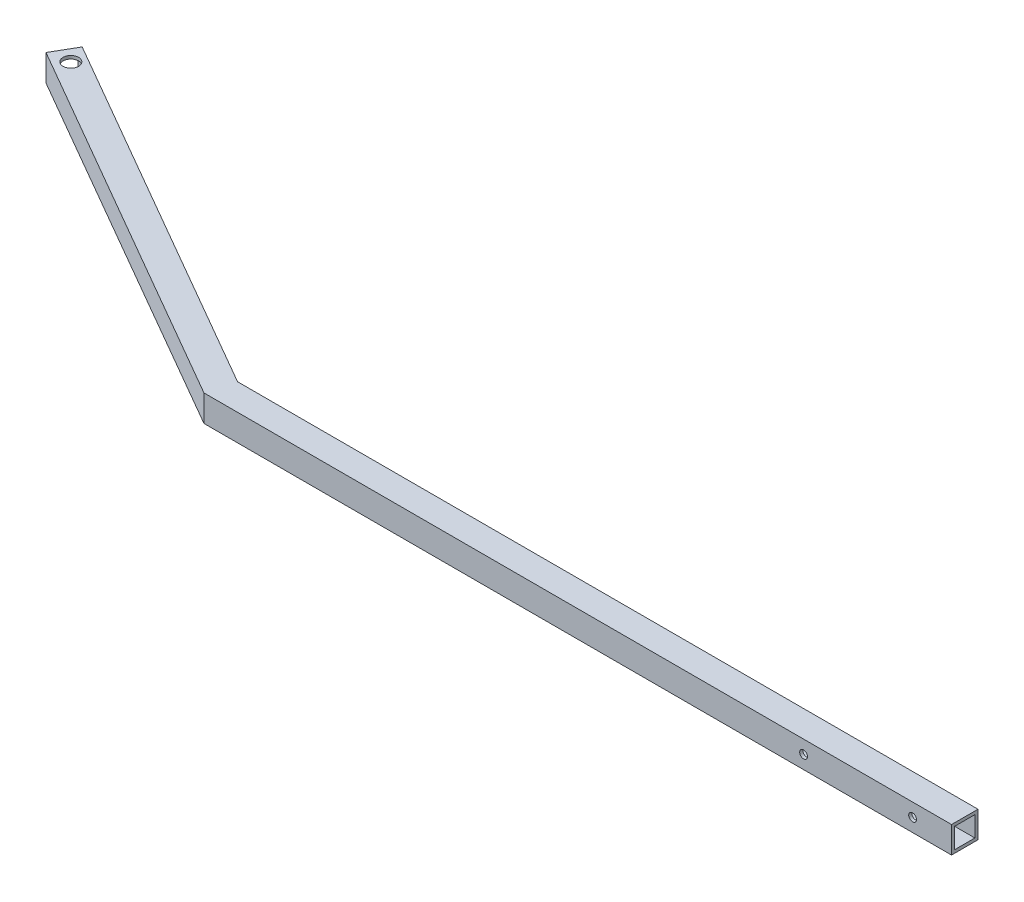
ISO-10303-21;
HEADER;
FILE_DESCRIPTION(('STEP AP214'),'2;1');
FILE_NAME('part.step','',(''),(''),'','','');
FILE_SCHEMA(('AUTOMOTIVE_DESIGN { 1 0 10303 214 1 1 1 1 }'));
ENDSEC;
DATA;
#1=APPLICATION_CONTEXT('core data for automotive mechanical design processes');
#2=APPLICATION_PROTOCOL_DEFINITION('international standard','automotive_design',2000,#1);
#3=PRODUCT_CONTEXT('',#1,'mechanical');
#4=PRODUCT('Part','Part','',(#3));
#5=PRODUCT_RELATED_PRODUCT_CATEGORY('part','',(#4));
#6=PRODUCT_DEFINITION_FORMATION('','',#4);
#7=PRODUCT_DEFINITION_CONTEXT('part definition',#1,'design');
#8=PRODUCT_DEFINITION('design','',#6,#7);
#9=PRODUCT_DEFINITION_SHAPE('','',#8);
#10=(LENGTH_UNIT() NAMED_UNIT(*) SI_UNIT(.MILLI.,.METRE.));
#11=(NAMED_UNIT(*) PLANE_ANGLE_UNIT() SI_UNIT($,.RADIAN.));
#12=(NAMED_UNIT(*) SI_UNIT($,.STERADIAN.) SOLID_ANGLE_UNIT());
#13=UNCERTAINTY_MEASURE_WITH_UNIT(LENGTH_MEASURE(1.E-05),#10,'distance_accuracy_value','');
#14=(GEOMETRIC_REPRESENTATION_CONTEXT(3) GLOBAL_UNCERTAINTY_ASSIGNED_CONTEXT((#13)) GLOBAL_UNIT_ASSIGNED_CONTEXT((#10,
#11,#12)) REPRESENTATION_CONTEXT('',''));
#15=CARTESIAN_POINT('',(0.,0.,0.));
#16=DIRECTION('',(0.,0.,1.));
#17=DIRECTION('',(1.,0.,0.));
#18=AXIS2_PLACEMENT_3D('',#15,#16,#17);
#19=CARTESIAN_POINT('',(0.,-21.59,-21.59));
#20=DIRECTION('',(1.,0.,0.));
#21=DIRECTION('',(0.,0.,-1.));
#22=AXIS2_PLACEMENT_3D('',#19,#20,#21);
#23=PLANE('',#22);
#24=DIRECTION('',(0.,0.,-1.));
#25=VECTOR('',#24,1.);
#26=CARTESIAN_POINT('',(0.,0.,-21.59));
#27=LINE('',#26,#25);
#28=CARTESIAN_POINT('',(0.,0.,0.));
#29=VERTEX_POINT('',#28);
#30=CARTESIAN_POINT('',(0.,0.,-21.59));
#31=VERTEX_POINT('',#30);
#32=EDGE_CURVE('E169',#29,#31,#27,.T.);
#33=ORIENTED_EDGE('',*,*,#32,.F.);
#34=DIRECTION('',(0.,1.,0.));
#35=VECTOR('',#34,1.);
#36=CARTESIAN_POINT('',(0.,-21.59,0.));
#37=LINE('',#36,#35);
#38=CARTESIAN_POINT('',(0.,-21.59,0.));
#39=VERTEX_POINT('',#38);
#40=EDGE_CURVE('E11',#39,#29,#37,.T.);
#41=ORIENTED_EDGE('',*,*,#40,.F.);
#42=DIRECTION('',(0.,0.,-1.));
#43=VECTOR('',#42,1.);
#44=CARTESIAN_POINT('',(0.,-21.59,-21.59));
#45=LINE('',#44,#43);
#46=CARTESIAN_POINT('',(0.,-21.59,-21.59));
#47=VERTEX_POINT('',#46);
#48=EDGE_CURVE('E180',#39,#47,#45,.T.);
#49=ORIENTED_EDGE('',*,*,#48,.T.);
#50=DIRECTION('',(0.,1.,0.));
#51=VECTOR('',#50,1.);
#52=CARTESIAN_POINT('',(0.,-21.59,-21.59));
#53=LINE('',#52,#51);
#54=EDGE_CURVE('E199',#47,#31,#53,.T.);
#55=ORIENTED_EDGE('',*,*,#54,.T.);
#56=EDGE_LOOP('',(#33,#41,#49,#55));
#57=FACE_BOUND('',#56,.T.);
#58=DIRECTION('',(0.,1.,0.));
#59=VECTOR('',#58,1.);
#60=CARTESIAN_POINT('',(0.,-21.59,-2.54));
#61=LINE('',#60,#59);
#62=CARTESIAN_POINT('',(0.,-19.05,-2.54));
#63=VERTEX_POINT('',#62);
#64=CARTESIAN_POINT('',(0.,-2.54,-2.54));
#65=VERTEX_POINT('',#64);
#66=EDGE_CURVE('E138',#63,#65,#61,.T.);
#67=ORIENTED_EDGE('',*,*,#66,.T.);
#68=DIRECTION('',(0.,0.,-1.));
#69=VECTOR('',#68,1.);
#70=CARTESIAN_POINT('',(0.,-2.54,-21.59));
#71=LINE('',#70,#69);
#72=CARTESIAN_POINT('',(0.,-2.54,-19.05));
#73=VERTEX_POINT('',#72);
#74=EDGE_CURVE('E167',#65,#73,#71,.T.);
#75=ORIENTED_EDGE('',*,*,#74,.T.);
#76=DIRECTION('',(0.,1.,0.));
#77=VECTOR('',#76,1.);
#78=CARTESIAN_POINT('',(0.,-21.59,-19.05));
#79=LINE('',#78,#77);
#80=CARTESIAN_POINT('',(0.,-19.05,-19.05));
#81=VERTEX_POINT('',#80);
#82=EDGE_CURVE('E146',#81,#73,#79,.T.);
#83=ORIENTED_EDGE('',*,*,#82,.F.);
#84=DIRECTION('',(0.,0.,-1.));
#85=VECTOR('',#84,1.);
#86=CARTESIAN_POINT('',(0.,-19.05,-21.59));
#87=LINE('',#86,#85);
#88=EDGE_CURVE('E53',#63,#81,#87,.T.);
#89=ORIENTED_EDGE('',*,*,#88,.F.);
#90=EDGE_LOOP('',(#67,#75,#83,#89));
#91=FACE_BOUND('',#90,.T.);
#92=ADVANCED_FACE('F37',(#57,#91),#23,.T.);
#93=CARTESIAN_POINT('',(-903.605,-21.59,-194.673850516704));
#94=DIRECTION('',(-0.866025403784441,0.,-0.499999999999996));
#95=DIRECTION('',(-0.499999999999996,0.,0.866025403784441));
#96=AXIS2_PLACEMENT_3D('',#93,#94,#95);
#97=PLANE('',#96);
#98=DIRECTION('',(-0.499999999999996,0.,0.866025403784441));
#99=VECTOR('',#98,1.);
#100=CARTESIAN_POINT('',(-903.605,0.,-194.673850516704));
#101=LINE('',#100,#99);
#102=CARTESIAN_POINT('',(-903.605,0.,-194.673850516704));
#103=VERTEX_POINT('',#102);
#104=CARTESIAN_POINT('',(-914.4,0.,-175.976362048998));
#105=VERTEX_POINT('',#104);
#106=EDGE_CURVE('E208',#103,#105,#101,.T.);
#107=ORIENTED_EDGE('',*,*,#106,.F.);
#108=DIRECTION('',(0.,1.,0.));
#109=VECTOR('',#108,1.);
#110=CARTESIAN_POINT('',(-903.605,-21.59,-194.673850516704));
#111=LINE('',#110,#109);
#112=CARTESIAN_POINT('',(-903.605,-21.59,-194.673850516704));
#113=VERTEX_POINT('',#112);
#114=EDGE_CURVE('E219',#113,#103,#111,.T.);
#115=ORIENTED_EDGE('',*,*,#114,.F.);
#116=DIRECTION('',(-0.499999999999996,0.,0.866025403784441));
#117=VECTOR('',#116,1.);
#118=CARTESIAN_POINT('',(-903.605,-21.59,-194.673850516704));
#119=LINE('',#118,#117);
#120=CARTESIAN_POINT('',(-914.4,-21.59,-175.976362048998));
#121=VERTEX_POINT('',#120);
#122=EDGE_CURVE('E190',#113,#121,#119,.T.);
#123=ORIENTED_EDGE('',*,*,#122,.T.);
#124=DIRECTION('',(0.,1.,0.));
#125=VECTOR('',#124,1.);
#126=CARTESIAN_POINT('',(-914.4,-21.59,-175.976362048998));
#127=LINE('',#126,#125);
#128=EDGE_CURVE('E217',#121,#105,#127,.T.);
#129=ORIENTED_EDGE('',*,*,#128,.T.);
#130=EDGE_LOOP('',(#107,#115,#123,#129));
#131=FACE_BOUND('',#130,.T.);
#132=DIRECTION('',(0.,1.,0.));
#133=VECTOR('',#132,1.);
#134=CARTESIAN_POINT('',(-904.875,-21.59,-192.474145991092));
#135=LINE('',#134,#133);
#136=CARTESIAN_POINT('',(-904.875,-19.05,-192.474145991092));
#137=VERTEX_POINT('',#136);
#138=CARTESIAN_POINT('',(-904.875,-2.54,-192.474145991092));
#139=VERTEX_POINT('',#138);
#140=EDGE_CURVE('E164',#137,#139,#135,.T.);
#141=ORIENTED_EDGE('',*,*,#140,.T.);
#142=DIRECTION('',(-0.499999999999996,0.,0.866025403784441));
#143=VECTOR('',#142,1.);
#144=CARTESIAN_POINT('',(-903.605,-2.54,-194.673850516704));
#145=LINE('',#144,#143);
#146=CARTESIAN_POINT('',(-913.13,-2.54,-178.176066574611));
#147=VERTEX_POINT('',#146);
#148=EDGE_CURVE('E153',#139,#147,#145,.T.);
#149=ORIENTED_EDGE('',*,*,#148,.T.);
#150=DIRECTION('',(0.,1.,0.));
#151=VECTOR('',#150,1.);
#152=CARTESIAN_POINT('',(-913.13,-21.59,-178.176066574611));
#153=LINE('',#152,#151);
#154=CARTESIAN_POINT('',(-913.13,-19.05,-178.176066574611));
#155=VERTEX_POINT('',#154);
#156=EDGE_CURVE('E139',#155,#147,#153,.T.);
#157=ORIENTED_EDGE('',*,*,#156,.F.);
#158=DIRECTION('',(-0.499999999999996,0.,0.866025403784441));
#159=VECTOR('',#158,1.);
#160=CARTESIAN_POINT('',(-903.605,-19.05,-194.673850516704));
#161=LINE('',#160,#159);
#162=EDGE_CURVE('E60',#137,#155,#161,.T.);
#163=ORIENTED_EDGE('',*,*,#162,.F.);
#164=EDGE_LOOP('',(#141,#149,#157,#163));
#165=FACE_BOUND('',#164,.T.);
#166=ADVANCED_FACE('F257',(#131,#165),#97,.T.);
#167=CARTESIAN_POINT('',(0.,-21.59,0.));
#168=DIRECTION('',(0.,0.,1.));
#169=DIRECTION('',(1.,0.,0.));
#170=AXIS2_PLACEMENT_3D('',#167,#168,#169);
#171=PLANE('',#170);
#172=CARTESIAN_POINT('',(-120.65,-10.7912696929059,0.));
#173=DIRECTION('',(0.,0.,1.));
#174=DIRECTION('',(1.,0.,0.));
#175=AXIS2_PLACEMENT_3D('',#172,#173,#174);
#176=CIRCLE('',#175,3.175);
#177=CARTESIAN_POINT('',(-117.475,-10.7912696929059,0.));
#178=VERTEX_POINT('',#177);
#179=EDGE_CURVE('E227',#178,#178,#176,.T.);
#180=ORIENTED_EDGE('',*,*,#179,.F.);
#181=EDGE_LOOP('',(#180));
#182=FACE_BOUND('',#181,.T.);
#183=CARTESIAN_POINT('',(-31.75,-10.7912696929059,0.));
#184=DIRECTION('',(0.,0.,1.));
#185=DIRECTION('',(1.,0.,0.));
#186=AXIS2_PLACEMENT_3D('',#183,#184,#185);
#187=CIRCLE('',#186,3.175);
#188=CARTESIAN_POINT('',(-28.575,-10.7912696929059,0.));
#189=VERTEX_POINT('',#188);
#190=EDGE_CURVE('E466',#189,#189,#187,.T.);
#191=ORIENTED_EDGE('',*,*,#190,.F.);
#192=EDGE_LOOP('',(#191));
#193=FACE_BOUND('',#192,.T.);
#194=DIRECTION('',(1.,0.,0.));
#195=VECTOR('',#194,1.);
#196=CARTESIAN_POINT('',(0.,0.,0.));
#197=LINE('',#196,#195);
#198=CARTESIAN_POINT('',(-609.6,0.,0.));
#199=VERTEX_POINT('',#198);
#200=EDGE_CURVE('E184',#199,#29,#197,.T.);
#201=ORIENTED_EDGE('',*,*,#200,.F.);
#202=DIRECTION('',(0.,1.,0.));
#203=VECTOR('',#202,1.);
#204=CARTESIAN_POINT('',(-609.6,-21.59,0.));
#205=LINE('',#204,#203);
#206=CARTESIAN_POINT('',(-609.6,-21.59,0.));
#207=VERTEX_POINT('',#206);
#208=EDGE_CURVE('E45',#207,#199,#205,.T.);
#209=ORIENTED_EDGE('',*,*,#208,.F.);
#210=DIRECTION('',(1.,0.,0.));
#211=VECTOR('',#210,1.);
#212=CARTESIAN_POINT('',(0.,-21.59,0.));
#213=LINE('',#212,#211);
#214=EDGE_CURVE('E196',#207,#39,#213,.T.);
#215=ORIENTED_EDGE('',*,*,#214,.T.);
#216=ORIENTED_EDGE('',*,*,#40,.T.);
#217=EDGE_LOOP('',(#201,#209,#215,#216));
#218=FACE_BOUND('',#217,.T.);
#219=ADVANCED_FACE('F259',(#182,#193,#218),#171,.T.);
#220=CARTESIAN_POINT('',(-609.6,-21.59,0.));
#221=DIRECTION('',(-0.500000000000001,0.,0.866025403784438));
#222=DIRECTION('',(0.866025403784438,0.,0.500000000000001));
#223=AXIS2_PLACEMENT_3D('',#220,#221,#222);
#224=PLANE('',#223);
#225=DIRECTION('',(0.866025403784438,0.,0.500000000000001));
#226=VECTOR('',#225,1.);
#227=CARTESIAN_POINT('',(-609.6,0.,0.));
#228=LINE('',#227,#226);
#229=EDGE_CURVE('E211',#105,#199,#228,.T.);
#230=ORIENTED_EDGE('',*,*,#229,.F.);
#231=ORIENTED_EDGE('',*,*,#128,.F.);
#232=DIRECTION('',(0.866025403784438,0.,0.500000000000001));
#233=VECTOR('',#232,1.);
#234=CARTESIAN_POINT('',(-609.6,-21.59,0.));
#235=LINE('',#234,#233);
#236=EDGE_CURVE('E193',#121,#207,#235,.T.);
#237=ORIENTED_EDGE('',*,*,#236,.T.);
#238=ORIENTED_EDGE('',*,*,#208,.T.);
#239=EDGE_LOOP('',(#230,#231,#237,#238));
#240=FACE_BOUND('',#239,.T.);
#241=ADVANCED_FACE('F266',(#240),#224,.T.);
#242=CARTESIAN_POINT('',(-603.814976935412,-21.59,-21.5899999999999));
#243=DIRECTION('',(0.500000000000001,0.,-0.866025403784438));
#244=DIRECTION('',(-0.866025403784438,0.,-0.500000000000001));
#245=AXIS2_PLACEMENT_3D('',#242,#243,#244);
#246=PLANE('',#245);
#247=DIRECTION('',(-0.866025403784438,0.,-0.500000000000001));
#248=VECTOR('',#247,1.);
#249=CARTESIAN_POINT('',(-603.814976935412,0.,-21.5899999999999));
#250=LINE('',#249,#248);
#251=CARTESIAN_POINT('',(-603.814976935412,0.,-21.5899999999999));
#252=VERTEX_POINT('',#251);
#253=EDGE_CURVE('E205',#252,#103,#250,.T.);
#254=ORIENTED_EDGE('',*,*,#253,.F.);
#255=DIRECTION('',(0.,1.,0.));
#256=VECTOR('',#255,1.);
#257=CARTESIAN_POINT('',(-603.814976935412,-21.59,-21.5899999999999));
#258=LINE('',#257,#256);
#259=CARTESIAN_POINT('',(-603.814976935412,-21.59,-21.5899999999999));
#260=VERTEX_POINT('',#259);
#261=EDGE_CURVE('E221',#260,#252,#258,.T.);
#262=ORIENTED_EDGE('',*,*,#261,.F.);
#263=DIRECTION('',(-0.866025403784438,0.,-0.500000000000001));
#264=VECTOR('',#263,1.);
#265=CARTESIAN_POINT('',(-603.814976935412,-21.59,-21.5899999999999));
#266=LINE('',#265,#264);
#267=EDGE_CURVE('E187',#260,#113,#266,.T.);
#268=ORIENTED_EDGE('',*,*,#267,.T.);
#269=ORIENTED_EDGE('',*,*,#114,.T.);
#270=EDGE_LOOP('',(#254,#262,#268,#269));
#271=FACE_BOUND('',#270,.T.);
#272=ADVANCED_FACE('F273',(#271),#246,.T.);
#273=CARTESIAN_POINT('',(0.,-21.59,-21.59));
#274=DIRECTION('',(0.,0.,-1.));
#275=DIRECTION('',(-1.,0.,0.));
#276=AXIS2_PLACEMENT_3D('',#273,#274,#275);
#277=PLANE('',#276);
#278=CARTESIAN_POINT('',(-120.65,-10.7912696929059,-21.59));
#279=DIRECTION('',(0.,0.,-1.));
#280=DIRECTION('',(-1.,0.,0.));
#281=AXIS2_PLACEMENT_3D('',#278,#279,#280);
#282=CIRCLE('',#281,3.175);
#283=CARTESIAN_POINT('',(-123.825,-10.7912696929059,-21.59));
#284=VERTEX_POINT('',#283);
#285=EDGE_CURVE('E173',#284,#284,#282,.T.);
#286=ORIENTED_EDGE('',*,*,#285,.F.);
#287=EDGE_LOOP('',(#286));
#288=FACE_BOUND('',#287,.T.);
#289=CARTESIAN_POINT('',(-31.75,-10.7912696929059,-21.59));
#290=DIRECTION('',(0.,0.,-1.));
#291=DIRECTION('',(-1.,0.,0.));
#292=AXIS2_PLACEMENT_3D('',#289,#290,#291);
#293=CIRCLE('',#292,3.175);
#294=CARTESIAN_POINT('',(-34.925,-10.7912696929059,-21.59));
#295=VERTEX_POINT('',#294);
#296=EDGE_CURVE('E231',#295,#295,#293,.T.);
#297=ORIENTED_EDGE('',*,*,#296,.F.);
#298=EDGE_LOOP('',(#297));
#299=FACE_BOUND('',#298,.T.);
#300=DIRECTION('',(-1.,0.,0.));
#301=VECTOR('',#300,1.);
#302=CARTESIAN_POINT('',(0.,0.,-21.59));
#303=LINE('',#302,#301);
#304=EDGE_CURVE('E202',#31,#252,#303,.T.);
#305=ORIENTED_EDGE('',*,*,#304,.F.);
#306=ORIENTED_EDGE('',*,*,#54,.F.);
#307=DIRECTION('',(-1.,0.,0.));
#308=VECTOR('',#307,1.);
#309=CARTESIAN_POINT('',(0.,-21.59,-21.59));
#310=LINE('',#309,#308);
#311=EDGE_CURVE('E183',#47,#260,#310,.T.);
#312=ORIENTED_EDGE('',*,*,#311,.T.);
#313=ORIENTED_EDGE('',*,*,#261,.T.);
#314=EDGE_LOOP('',(#305,#306,#312,#313));
#315=FACE_BOUND('',#314,.T.);
#316=ADVANCED_FACE('F275',(#288,#299,#315),#277,.T.);
#317=CARTESIAN_POINT('',(0.,-21.59,0.));
#318=DIRECTION('',(0.,-1.,0.));
#319=DIRECTION('',(0.,0.,-1.));
#320=AXIS2_PLACEMENT_3D('',#317,#318,#319);
#321=PLANE('',#320);
#322=CARTESIAN_POINT('',(-897.686477371938,-21.59,-179.525032414254));
#323=DIRECTION('',(0.,1.,0.));
#324=DIRECTION('',(0.,0.,1.));
#325=AXIS2_PLACEMENT_3D('',#322,#323,#324);
#326=CIRCLE('',#325,6.34999999999994);
#327=CARTESIAN_POINT('',(-897.686477371938,-21.59,-173.175032414254));
#328=VERTEX_POINT('',#327);
#329=EDGE_CURVE('E462',#328,#328,#326,.T.);
#330=ORIENTED_EDGE('',*,*,#329,.T.);
#331=EDGE_LOOP('',(#330));
#332=FACE_BOUND('',#331,.T.);
#333=ORIENTED_EDGE('',*,*,#48,.F.);
#334=ORIENTED_EDGE('',*,*,#214,.F.);
#335=ORIENTED_EDGE('',*,*,#236,.F.);
#336=ORIENTED_EDGE('',*,*,#122,.F.);
#337=ORIENTED_EDGE('',*,*,#267,.F.);
#338=ORIENTED_EDGE('',*,*,#311,.F.);
#339=EDGE_LOOP('',(#333,#334,#335,#336,#337,#338));
#340=FACE_BOUND('',#339,.T.);
#341=ADVANCED_FACE('F278',(#332,#340),#321,.T.);
#342=CARTESIAN_POINT('',(0.,0.,0.));
#343=DIRECTION('',(0.,-1.,0.));
#344=DIRECTION('',(0.,0.,-1.));
#345=AXIS2_PLACEMENT_3D('',#342,#343,#344);
#346=PLANE('',#345);
#347=CARTESIAN_POINT('',(-897.686477371938,0.,-179.525032414254));
#348=DIRECTION('',(0.,1.,0.));
#349=DIRECTION('',(0.,0.,1.));
#350=AXIS2_PLACEMENT_3D('',#347,#348,#349);
#351=CIRCLE('',#350,6.34999999999994);
#352=CARTESIAN_POINT('',(-897.686477371938,0.,-173.175032414254));
#353=VERTEX_POINT('',#352);
#354=EDGE_CURVE('E472',#353,#353,#351,.T.);
#355=ORIENTED_EDGE('',*,*,#354,.F.);
#356=EDGE_LOOP('',(#355));
#357=FACE_BOUND('',#356,.T.);
#358=ORIENTED_EDGE('',*,*,#32,.T.);
#359=ORIENTED_EDGE('',*,*,#304,.T.);
#360=ORIENTED_EDGE('',*,*,#253,.T.);
#361=ORIENTED_EDGE('',*,*,#106,.T.);
#362=ORIENTED_EDGE('',*,*,#229,.T.);
#363=ORIENTED_EDGE('',*,*,#200,.T.);
#364=EDGE_LOOP('',(#358,#359,#360,#361,#362,#363));
#365=FACE_BOUND('',#364,.T.);
#366=ADVANCED_FACE('F283',(#357,#365),#346,.F.);
#367=CARTESIAN_POINT('',(0.,-21.59,-2.54));
#368=DIRECTION('',(0.,0.,1.));
#369=DIRECTION('',(1.,0.,0.));
#370=AXIS2_PLACEMENT_3D('',#367,#368,#369);
#371=PLANE('',#370);
#372=CARTESIAN_POINT('',(-120.65,-10.7912696929059,-2.53999999999996));
#373=DIRECTION('',(0.,0.,1.));
#374=DIRECTION('',(1.,0.,0.));
#375=AXIS2_PLACEMENT_3D('',#372,#373,#374);
#376=CIRCLE('',#375,3.175);
#377=CARTESIAN_POINT('',(-117.475,-10.7912696929059,-2.53999999999996));
#378=VERTEX_POINT('',#377);
#379=EDGE_CURVE('E230',#378,#378,#376,.T.);
#380=ORIENTED_EDGE('',*,*,#379,.T.);
#381=EDGE_LOOP('',(#380));
#382=FACE_BOUND('',#381,.T.);
#383=CARTESIAN_POINT('',(-31.75,-10.7912696929059,-2.53999999999999));
#384=DIRECTION('',(0.,0.,1.));
#385=DIRECTION('',(1.,0.,0.));
#386=AXIS2_PLACEMENT_3D('',#383,#384,#385);
#387=CIRCLE('',#386,3.175);
#388=CARTESIAN_POINT('',(-28.575,-10.7912696929059,-2.53999999999999));
#389=VERTEX_POINT('',#388);
#390=EDGE_CURVE('E226',#389,#389,#387,.T.);
#391=ORIENTED_EDGE('',*,*,#390,.T.);
#392=EDGE_LOOP('',(#391));
#393=FACE_BOUND('',#392,.T.);
#394=DIRECTION('',(1.,0.,0.));
#395=VECTOR('',#394,1.);
#396=CARTESIAN_POINT('',(0.,-2.54,-2.54));
#397=LINE('',#396,#395);
#398=CARTESIAN_POINT('',(-608.919409051225,-2.54,-2.53999999999993));
#399=VERTEX_POINT('',#398);
#400=EDGE_CURVE('E152',#399,#65,#397,.T.);
#401=ORIENTED_EDGE('',*,*,#400,.T.);
#402=ORIENTED_EDGE('',*,*,#66,.F.);
#403=DIRECTION('',(1.,0.,0.));
#404=VECTOR('',#403,1.);
#405=CARTESIAN_POINT('',(0.,-19.05,-2.54));
#406=LINE('',#405,#404);
#407=CARTESIAN_POINT('',(-608.919409051225,-19.05,-2.53999999999993));
#408=VERTEX_POINT('',#407);
#409=EDGE_CURVE('E142',#408,#63,#406,.T.);
#410=ORIENTED_EDGE('',*,*,#409,.F.);
#411=DIRECTION('',(0.,1.,0.));
#412=VECTOR('',#411,1.);
#413=CARTESIAN_POINT('',(-608.919409051225,-21.59,-2.53999999999993));
#414=LINE('',#413,#412);
#415=EDGE_CURVE('E128',#408,#399,#414,.T.);
#416=ORIENTED_EDGE('',*,*,#415,.T.);
#417=EDGE_LOOP('',(#401,#402,#410,#416));
#418=FACE_BOUND('',#417,.T.);
#419=ADVANCED_FACE('F144',(#382,#393,#418),#371,.F.);
#420=CARTESIAN_POINT('',(-608.33,-21.59,-2.1997045256124));
#421=DIRECTION('',(-0.500000000000001,0.,0.866025403784438));
#422=DIRECTION('',(0.866025403784438,0.,0.500000000000001));
#423=AXIS2_PLACEMENT_3D('',#420,#421,#422);
#424=PLANE('',#423);
#425=DIRECTION('',(0.866025403784438,0.,0.500000000000001));
#426=VECTOR('',#425,1.);
#427=CARTESIAN_POINT('',(-608.33,-2.54,-2.1997045256124));
#428=LINE('',#427,#426);
#429=EDGE_CURVE('E133',#147,#399,#428,.T.);
#430=ORIENTED_EDGE('',*,*,#429,.T.);
#431=ORIENTED_EDGE('',*,*,#415,.F.);
#432=DIRECTION('',(0.866025403784438,0.,0.500000000000001));
#433=VECTOR('',#432,1.);
#434=CARTESIAN_POINT('',(-608.33,-19.05,-2.1997045256124));
#435=LINE('',#434,#433);
#436=EDGE_CURVE('E130',#155,#408,#435,.T.);
#437=ORIENTED_EDGE('',*,*,#436,.F.);
#438=ORIENTED_EDGE('',*,*,#156,.T.);
#439=EDGE_LOOP('',(#430,#431,#437,#438));
#440=FACE_BOUND('',#439,.T.);
#441=ADVANCED_FACE('F129',(#440),#424,.F.);
#442=CARTESIAN_POINT('',(-605.084976935412,-21.59,-19.3902954743875));
#443=DIRECTION('',(0.500000000000001,0.,-0.866025403784438));
#444=DIRECTION('',(-0.866025403784438,0.,-0.500000000000001));
#445=AXIS2_PLACEMENT_3D('',#442,#443,#444);
#446=PLANE('',#445);
#447=DIRECTION('',(-0.866025403784438,0.,-0.500000000000001));
#448=VECTOR('',#447,1.);
#449=CARTESIAN_POINT('',(-605.084976935412,-2.54,-19.3902954743875));
#450=LINE('',#449,#448);
#451=CARTESIAN_POINT('',(-604.495567884187,-2.54,-19.0499999999999));
#452=VERTEX_POINT('',#451);
#453=EDGE_CURVE('E159',#452,#139,#450,.T.);
#454=ORIENTED_EDGE('',*,*,#453,.T.);
#455=ORIENTED_EDGE('',*,*,#140,.F.);
#456=DIRECTION('',(-0.866025403784438,0.,-0.500000000000001));
#457=VECTOR('',#456,1.);
#458=CARTESIAN_POINT('',(-605.084976935412,-19.05,-19.3902954743875));
#459=LINE('',#458,#457);
#460=CARTESIAN_POINT('',(-604.495567884187,-19.05,-19.0499999999999));
#461=VERTEX_POINT('',#460);
#462=EDGE_CURVE('E155',#461,#137,#459,.T.);
#463=ORIENTED_EDGE('',*,*,#462,.F.);
#464=DIRECTION('',(0.,1.,0.));
#465=VECTOR('',#464,1.);
#466=CARTESIAN_POINT('',(-604.495567884187,-21.59,-19.0499999999999));
#467=LINE('',#466,#465);
#468=EDGE_CURVE('E148',#461,#452,#467,.T.);
#469=ORIENTED_EDGE('',*,*,#468,.T.);
#470=EDGE_LOOP('',(#454,#455,#463,#469));
#471=FACE_BOUND('',#470,.T.);
#472=ADVANCED_FACE('F254',(#471),#446,.F.);
#473=CARTESIAN_POINT('',(0.,-21.59,-19.05));
#474=DIRECTION('',(0.,0.,-1.));
#475=DIRECTION('',(-1.,0.,0.));
#476=AXIS2_PLACEMENT_3D('',#473,#474,#475);
#477=PLANE('',#476);
#478=CARTESIAN_POINT('',(-120.65,-10.7912696929059,-19.05));
#479=DIRECTION('',(0.,0.,-1.));
#480=DIRECTION('',(-1.,0.,0.));
#481=AXIS2_PLACEMENT_3D('',#478,#479,#480);
#482=CIRCLE('',#481,3.175);
#483=CARTESIAN_POINT('',(-123.825,-10.7912696929059,-19.05));
#484=VERTEX_POINT('',#483);
#485=EDGE_CURVE('E228',#484,#484,#482,.T.);
#486=ORIENTED_EDGE('',*,*,#485,.T.);
#487=EDGE_LOOP('',(#486));
#488=FACE_BOUND('',#487,.T.);
#489=CARTESIAN_POINT('',(-31.75,-10.7912696929059,-19.05));
#490=DIRECTION('',(0.,0.,-1.));
#491=DIRECTION('',(-1.,0.,0.));
#492=AXIS2_PLACEMENT_3D('',#489,#490,#491);
#493=CIRCLE('',#492,3.175);
#494=CARTESIAN_POINT('',(-34.925,-10.7912696929059,-19.05));
#495=VERTEX_POINT('',#494);
#496=EDGE_CURVE('E224',#495,#495,#493,.T.);
#497=ORIENTED_EDGE('',*,*,#496,.T.);
#498=EDGE_LOOP('',(#497));
#499=FACE_BOUND('',#498,.T.);
#500=DIRECTION('',(-1.,0.,0.));
#501=VECTOR('',#500,1.);
#502=CARTESIAN_POINT('',(0.,-2.54,-19.05));
#503=LINE('',#502,#501);
#504=EDGE_CURVE('E162',#73,#452,#503,.T.);
#505=ORIENTED_EDGE('',*,*,#504,.T.);
#506=ORIENTED_EDGE('',*,*,#468,.F.);
#507=DIRECTION('',(-1.,0.,0.));
#508=VECTOR('',#507,1.);
#509=CARTESIAN_POINT('',(0.,-19.05,-19.05));
#510=LINE('',#509,#508);
#511=EDGE_CURVE('E157',#81,#461,#510,.T.);
#512=ORIENTED_EDGE('',*,*,#511,.F.);
#513=ORIENTED_EDGE('',*,*,#82,.T.);
#514=EDGE_LOOP('',(#505,#506,#512,#513));
#515=FACE_BOUND('',#514,.T.);
#516=ADVANCED_FACE('F250',(#488,#499,#515),#477,.F.);
#517=CARTESIAN_POINT('',(0.,-19.05,0.));
#518=DIRECTION('',(0.,-1.,0.));
#519=DIRECTION('',(0.,0.,-1.));
#520=AXIS2_PLACEMENT_3D('',#517,#518,#519);
#521=PLANE('',#520);
#522=CARTESIAN_POINT('',(-897.686477371938,-19.05,-179.525032414254));
#523=DIRECTION('',(0.,-1.,0.));
#524=DIRECTION('',(0.,0.,-1.));
#525=AXIS2_PLACEMENT_3D('',#522,#523,#524);
#526=CIRCLE('',#525,6.34999999999994);
#527=CARTESIAN_POINT('',(-897.686477371938,-19.05,-185.875032414254));
#528=VERTEX_POINT('',#527);
#529=EDGE_CURVE('E465',#528,#528,#526,.T.);
#530=ORIENTED_EDGE('',*,*,#529,.T.);
#531=EDGE_LOOP('',(#530));
#532=FACE_BOUND('',#531,.T.);
#533=ORIENTED_EDGE('',*,*,#88,.T.);
#534=ORIENTED_EDGE('',*,*,#511,.T.);
#535=ORIENTED_EDGE('',*,*,#462,.T.);
#536=ORIENTED_EDGE('',*,*,#162,.T.);
#537=ORIENTED_EDGE('',*,*,#436,.T.);
#538=ORIENTED_EDGE('',*,*,#409,.T.);
#539=EDGE_LOOP('',(#533,#534,#535,#536,#537,#538));
#540=FACE_BOUND('',#539,.T.);
#541=ADVANCED_FACE('F141',(#532,#540),#521,.F.);
#542=CARTESIAN_POINT('',(0.,-2.54,0.));
#543=DIRECTION('',(0.,-1.,0.));
#544=DIRECTION('',(0.,0.,-1.));
#545=AXIS2_PLACEMENT_3D('',#542,#543,#544);
#546=PLANE('',#545);
#547=CARTESIAN_POINT('',(-897.686477371938,-2.54,-179.525032414254));
#548=DIRECTION('',(0.,-1.,0.));
#549=DIRECTION('',(0.,0.,-1.));
#550=AXIS2_PLACEMENT_3D('',#547,#548,#549);
#551=CIRCLE('',#550,6.34999999999994);
#552=CARTESIAN_POINT('',(-897.686477371938,-2.54,-185.875032414254));
#553=VERTEX_POINT('',#552);
#554=EDGE_CURVE('E40',#553,#553,#551,.T.);
#555=ORIENTED_EDGE('',*,*,#554,.F.);
#556=EDGE_LOOP('',(#555));
#557=FACE_BOUND('',#556,.T.);
#558=ORIENTED_EDGE('',*,*,#74,.F.);
#559=ORIENTED_EDGE('',*,*,#400,.F.);
#560=ORIENTED_EDGE('',*,*,#429,.F.);
#561=ORIENTED_EDGE('',*,*,#148,.F.);
#562=ORIENTED_EDGE('',*,*,#453,.F.);
#563=ORIENTED_EDGE('',*,*,#504,.F.);
#564=EDGE_LOOP('',(#558,#559,#560,#561,#562,#563));
#565=FACE_BOUND('',#564,.T.);
#566=ADVANCED_FACE('F252',(#557,#565),#546,.T.);
#567=CARTESIAN_POINT('',(-31.75,-10.7912696929059,-194.673850516704));
#568=DIRECTION('',(0.,0.,1.));
#569=DIRECTION('',(1.,0.,0.));
#570=AXIS2_PLACEMENT_3D('',#567,#568,#569);
#571=CYLINDRICAL_SURFACE('',#570,3.175);
#572=ORIENTED_EDGE('',*,*,#296,.T.);
#573=EDGE_LOOP('',(#572));
#574=FACE_BOUND('',#573,.T.);
#575=ORIENTED_EDGE('',*,*,#496,.F.);
#576=EDGE_LOOP('',(#575));
#577=FACE_BOUND('',#576,.T.);
#578=ADVANCED_FACE('F376',(#574,#577),#571,.F.);
#579=CARTESIAN_POINT('',(-120.65,-10.7912696929059,-194.673850516704));
#580=DIRECTION('',(0.,0.,1.));
#581=DIRECTION('',(1.,0.,0.));
#582=AXIS2_PLACEMENT_3D('',#579,#580,#581);
#583=CYLINDRICAL_SURFACE('',#582,3.175);
#584=ORIENTED_EDGE('',*,*,#285,.T.);
#585=EDGE_LOOP('',(#584));
#586=FACE_BOUND('',#585,.T.);
#587=ORIENTED_EDGE('',*,*,#485,.F.);
#588=EDGE_LOOP('',(#587));
#589=FACE_BOUND('',#588,.T.);
#590=ADVANCED_FACE('F381',(#586,#589),#583,.F.);
#591=ORIENTED_EDGE('',*,*,#190,.T.);
#592=EDGE_LOOP('',(#591));
#593=FACE_BOUND('',#592,.T.);
#594=ORIENTED_EDGE('',*,*,#390,.F.);
#595=EDGE_LOOP('',(#594));
#596=FACE_BOUND('',#595,.T.);
#597=ADVANCED_FACE('F383',(#593,#596),#571,.F.);
#598=ORIENTED_EDGE('',*,*,#179,.T.);
#599=EDGE_LOOP('',(#598));
#600=FACE_BOUND('',#599,.T.);
#601=ORIENTED_EDGE('',*,*,#379,.F.);
#602=EDGE_LOOP('',(#601));
#603=FACE_BOUND('',#602,.T.);
#604=ADVANCED_FACE('F395',(#600,#603),#583,.F.);
#605=CARTESIAN_POINT('',(-897.686477371938,-21.59,-179.525032414254));
#606=DIRECTION('',(0.,1.,0.));
#607=DIRECTION('',(0.,0.,1.));
#608=AXIS2_PLACEMENT_3D('',#605,#606,#607);
#609=CYLINDRICAL_SURFACE('',#608,6.34999999999994);
#610=ORIENTED_EDGE('',*,*,#554,.T.);
#611=EDGE_LOOP('',(#610));
#612=FACE_BOUND('',#611,.T.);
#613=ORIENTED_EDGE('',*,*,#354,.T.);
#614=EDGE_LOOP('',(#613));
#615=FACE_BOUND('',#614,.T.);
#616=ADVANCED_FACE('F411',(#612,#615),#609,.F.);
#617=ORIENTED_EDGE('',*,*,#329,.F.);
#618=EDGE_LOOP('',(#617));
#619=FACE_BOUND('',#618,.T.);
#620=ORIENTED_EDGE('',*,*,#529,.F.);
#621=EDGE_LOOP('',(#620));
#622=FACE_BOUND('',#621,.T.);
#623=ADVANCED_FACE('F446',(#619,#622),#609,.F.);
#624=CLOSED_SHELL('',(#92,#166,#219,#241,#272,#316,#341,#366,#419,#441,#472,#516,#541,#566,#578,
#590,#597,#604,#616,#623));
#625=MANIFOLD_SOLID_BREP('B2',#624);
#626=ADVANCED_BREP_SHAPE_REPRESENTATION('',(#18,#625),#14);
#627=SHAPE_DEFINITION_REPRESENTATION(#9,#626);
ENDSEC;
END-ISO-10303-21;
